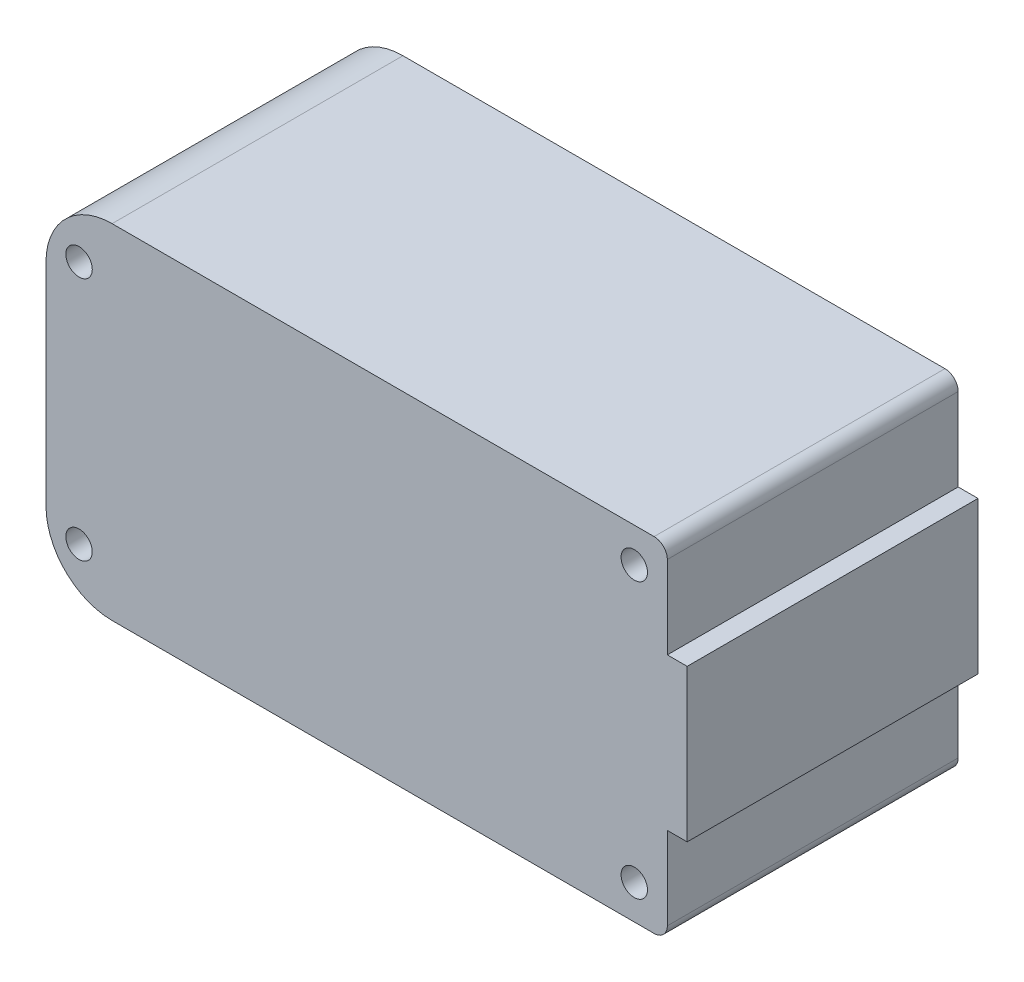
ISO-10303-21;
HEADER;
FILE_DESCRIPTION(('STEP AP214'),'2;1');
FILE_NAME('part.step','',(''),(''),'','','');
FILE_SCHEMA(('AUTOMOTIVE_DESIGN { 1 0 10303 214 1 1 1 1 }'));
ENDSEC;
DATA;
#1=APPLICATION_CONTEXT('core data for automotive mechanical design processes');
#2=APPLICATION_PROTOCOL_DEFINITION('international standard','automotive_design',2000,#1);
#3=PRODUCT_CONTEXT('',#1,'mechanical');
#4=PRODUCT('Part','Part','',(#3));
#5=PRODUCT_RELATED_PRODUCT_CATEGORY('part','',(#4));
#6=PRODUCT_DEFINITION_FORMATION('','',#4);
#7=PRODUCT_DEFINITION_CONTEXT('part definition',#1,'design');
#8=PRODUCT_DEFINITION('design','',#6,#7);
#9=PRODUCT_DEFINITION_SHAPE('','',#8);
#10=(LENGTH_UNIT() NAMED_UNIT(*) SI_UNIT(.MILLI.,.METRE.));
#11=(NAMED_UNIT(*) PLANE_ANGLE_UNIT() SI_UNIT($,.RADIAN.));
#12=(NAMED_UNIT(*) SI_UNIT($,.STERADIAN.) SOLID_ANGLE_UNIT());
#13=UNCERTAINTY_MEASURE_WITH_UNIT(LENGTH_MEASURE(1.E-05),#10,'distance_accuracy_value','');
#14=(GEOMETRIC_REPRESENTATION_CONTEXT(3) GLOBAL_UNCERTAINTY_ASSIGNED_CONTEXT((#13)) GLOBAL_UNIT_ASSIGNED_CONTEXT((#10,
#11,#12)) REPRESENTATION_CONTEXT('',''));
#15=CARTESIAN_POINT('',(0.,0.,0.));
#16=DIRECTION('',(0.,0.,1.));
#17=DIRECTION('',(1.,0.,0.));
#18=AXIS2_PLACEMENT_3D('',#15,#16,#17);
#19=CARTESIAN_POINT('',(0.,0.,11.));
#20=DIRECTION('',(0.,0.,1.));
#21=DIRECTION('',(1.,0.,0.));
#22=AXIS2_PLACEMENT_3D('',#19,#20,#21);
#23=PLANE('',#22);
#24=CARTESIAN_POINT('',(33.,-10.4,11.));
#25=DIRECTION('',(0.,0.,1.));
#26=DIRECTION('',(-1.,0.,0.));
#27=AXIS2_PLACEMENT_3D('',#24,#25,#26);
#28=CIRCLE('',#27,0.999999999999998);
#29=CARTESIAN_POINT('',(32.,-10.4,11.));
#30=VERTEX_POINT('',#29);
#31=EDGE_CURVE('E264',#30,#30,#28,.T.);
#32=ORIENTED_EDGE('',*,*,#31,.F.);
#33=EDGE_LOOP('',(#32));
#34=FACE_BOUND('',#33,.T.);
#35=CARTESIAN_POINT('',(-9.,9.25,11.));
#36=DIRECTION('',(0.,0.,1.));
#37=DIRECTION('',(1.,0.,0.));
#38=AXIS2_PLACEMENT_3D('',#35,#36,#37);
#39=CIRCLE('',#38,1.);
#40=CARTESIAN_POINT('',(-7.99999999999999,9.25,11.));
#41=VERTEX_POINT('',#40);
#42=EDGE_CURVE('E163',#41,#41,#39,.T.);
#43=ORIENTED_EDGE('',*,*,#42,.F.);
#44=EDGE_LOOP('',(#43));
#45=FACE_BOUND('',#44,.T.);
#46=DIRECTION('',(0.,1.,0.));
#47=VECTOR('',#46,1.);
#48=CARTESIAN_POINT('',(35.5,5.75,11.));
#49=LINE('',#48,#47);
#50=CARTESIAN_POINT('',(35.5,5.75,11.));
#51=VERTEX_POINT('',#50);
#52=CARTESIAN_POINT('',(35.5,12.,11.));
#53=VERTEX_POINT('',#52);
#54=EDGE_CURVE('E154',#51,#53,#49,.T.);
#55=ORIENTED_EDGE('',*,*,#54,.T.);
#56=CARTESIAN_POINT('',(34.5,12.,11.));
#57=DIRECTION('',(0.,0.,1.));
#58=DIRECTION('',(1.,0.,0.));
#59=AXIS2_PLACEMENT_3D('',#56,#57,#58);
#60=CIRCLE('',#59,1.);
#61=CARTESIAN_POINT('',(34.5,13.,11.));
#62=VERTEX_POINT('',#61);
#63=EDGE_CURVE('E213',#53,#62,#60,.T.);
#64=ORIENTED_EDGE('',*,*,#63,.T.);
#65=DIRECTION('',(-1.,0.,0.));
#66=VECTOR('',#65,1.);
#67=CARTESIAN_POINT('',(35.5,13.,11.));
#68=LINE('',#67,#66);
#69=CARTESIAN_POINT('',(-6.5,13.,11.));
#70=VERTEX_POINT('',#69);
#71=EDGE_CURVE('E156',#62,#70,#68,.T.);
#72=ORIENTED_EDGE('',*,*,#71,.T.);
#73=CARTESIAN_POINT('',(-6.5,7.99999999999999,11.));
#74=DIRECTION('',(0.,0.,1.));
#75=DIRECTION('',(1.,0.,0.));
#76=AXIS2_PLACEMENT_3D('',#73,#74,#75);
#77=CIRCLE('',#76,5.);
#78=CARTESIAN_POINT('',(-11.5,7.99999999999999,11.));
#79=VERTEX_POINT('',#78);
#80=EDGE_CURVE('E198',#70,#79,#77,.T.);
#81=ORIENTED_EDGE('',*,*,#80,.T.);
#82=DIRECTION('',(0.,-1.,0.));
#83=VECTOR('',#82,1.);
#84=CARTESIAN_POINT('',(-11.5,-13.,11.));
#85=LINE('',#84,#83);
#86=CARTESIAN_POINT('',(-11.5,-8.00000000000001,11.));
#87=VERTEX_POINT('',#86);
#88=EDGE_CURVE('E177',#79,#87,#85,.T.);
#89=ORIENTED_EDGE('',*,*,#88,.T.);
#90=CARTESIAN_POINT('',(-6.5,-8.,11.));
#91=DIRECTION('',(0.,0.,1.));
#92=DIRECTION('',(1.,0.,0.));
#93=AXIS2_PLACEMENT_3D('',#90,#91,#92);
#94=CIRCLE('',#93,5.);
#95=CARTESIAN_POINT('',(-6.5,-13.,11.));
#96=VERTEX_POINT('',#95);
#97=EDGE_CURVE('E196',#87,#96,#94,.T.);
#98=ORIENTED_EDGE('',*,*,#97,.T.);
#99=DIRECTION('',(1.,0.,0.));
#100=VECTOR('',#99,1.);
#101=CARTESIAN_POINT('',(35.5,-13.,11.));
#102=LINE('',#101,#100);
#103=CARTESIAN_POINT('',(34.5,-13.,11.));
#104=VERTEX_POINT('',#103);
#105=EDGE_CURVE('E132',#96,#104,#102,.T.);
#106=ORIENTED_EDGE('',*,*,#105,.T.);
#107=CARTESIAN_POINT('',(34.5,-12.,11.));
#108=DIRECTION('',(0.,0.,1.));
#109=DIRECTION('',(1.,0.,0.));
#110=AXIS2_PLACEMENT_3D('',#107,#108,#109);
#111=CIRCLE('',#110,1.);
#112=CARTESIAN_POINT('',(35.5,-12.,11.));
#113=VERTEX_POINT('',#112);
#114=EDGE_CURVE('E51',#104,#113,#111,.T.);
#115=ORIENTED_EDGE('',*,*,#114,.T.);
#116=DIRECTION('',(0.,1.,0.));
#117=VECTOR('',#116,1.);
#118=CARTESIAN_POINT('',(35.5,-13.,11.));
#119=LINE('',#118,#117);
#120=CARTESIAN_POINT('',(35.5,-5.75,11.));
#121=VERTEX_POINT('',#120);
#122=EDGE_CURVE('E122',#113,#121,#119,.T.);
#123=ORIENTED_EDGE('',*,*,#122,.T.);
#124=DIRECTION('',(1.,0.,0.));
#125=VECTOR('',#124,1.);
#126=CARTESIAN_POINT('',(35.5,-5.75,11.));
#127=LINE('',#126,#125);
#128=CARTESIAN_POINT('',(37.,-5.75,11.));
#129=VERTEX_POINT('',#128);
#130=EDGE_CURVE('E127',#121,#129,#127,.T.);
#131=ORIENTED_EDGE('',*,*,#130,.T.);
#132=DIRECTION('',(0.,1.,0.));
#133=VECTOR('',#132,1.);
#134=CARTESIAN_POINT('',(37.,5.75,11.));
#135=LINE('',#134,#133);
#136=CARTESIAN_POINT('',(37.,5.75,11.));
#137=VERTEX_POINT('',#136);
#138=EDGE_CURVE('E147',#129,#137,#135,.T.);
#139=ORIENTED_EDGE('',*,*,#138,.T.);
#140=DIRECTION('',(-1.,0.,0.));
#141=VECTOR('',#140,1.);
#142=CARTESIAN_POINT('',(35.5,5.75,11.));
#143=LINE('',#142,#141);
#144=EDGE_CURVE('E149',#137,#51,#143,.T.);
#145=ORIENTED_EDGE('',*,*,#144,.T.);
#146=EDGE_LOOP('',(#55,#64,#72,#81,#89,#98,#106,#115,#123,#131,#139,#145));
#147=FACE_BOUND('',#146,.T.);
#148=CARTESIAN_POINT('',(33.,10.4,11.));
#149=DIRECTION('',(0.,0.,1.));
#150=DIRECTION('',(1.,0.,0.));
#151=AXIS2_PLACEMENT_3D('',#148,#149,#150);
#152=CIRCLE('',#151,0.999999999999998);
#153=CARTESIAN_POINT('',(34.,10.4,11.));
#154=VERTEX_POINT('',#153);
#155=EDGE_CURVE('E258',#154,#154,#152,.T.);
#156=ORIENTED_EDGE('',*,*,#155,.F.);
#157=EDGE_LOOP('',(#156));
#158=FACE_BOUND('',#157,.T.);
#159=CARTESIAN_POINT('',(-9.,-9.25,11.));
#160=DIRECTION('',(0.,0.,1.));
#161=DIRECTION('',(-1.,0.,0.));
#162=AXIS2_PLACEMENT_3D('',#159,#160,#161);
#163=CIRCLE('',#162,1.);
#164=CARTESIAN_POINT('',(-10.,-9.25,11.));
#165=VERTEX_POINT('',#164);
#166=EDGE_CURVE('E270',#165,#165,#163,.T.);
#167=ORIENTED_EDGE('',*,*,#166,.F.);
#168=EDGE_LOOP('',(#167));
#169=FACE_BOUND('',#168,.T.);
#170=ADVANCED_FACE('F36',(#34,#45,#147,#158,#169),#23,.T.);
#171=CARTESIAN_POINT('',(0.,0.,-11.));
#172=DIRECTION('',(0.,0.,1.));
#173=DIRECTION('',(1.,0.,0.));
#174=AXIS2_PLACEMENT_3D('',#171,#172,#173);
#175=PLANE('',#174);
#176=CARTESIAN_POINT('',(33.,-10.4,-11.));
#177=DIRECTION('',(0.,0.,1.));
#178=DIRECTION('',(-1.,0.,0.));
#179=AXIS2_PLACEMENT_3D('',#176,#177,#178);
#180=CIRCLE('',#179,0.999999999999998);
#181=CARTESIAN_POINT('',(32.,-10.4,-11.));
#182=VERTEX_POINT('',#181);
#183=EDGE_CURVE('E267',#182,#182,#180,.T.);
#184=ORIENTED_EDGE('',*,*,#183,.T.);
#185=EDGE_LOOP('',(#184));
#186=FACE_BOUND('',#185,.T.);
#187=CARTESIAN_POINT('',(-9.,9.25,-11.));
#188=DIRECTION('',(0.,0.,1.));
#189=DIRECTION('',(1.,0.,0.));
#190=AXIS2_PLACEMENT_3D('',#187,#188,#189);
#191=CIRCLE('',#190,1.);
#192=CARTESIAN_POINT('',(-7.99999999999999,9.25,-11.));
#193=VERTEX_POINT('',#192);
#194=EDGE_CURVE('E255',#193,#193,#191,.T.);
#195=ORIENTED_EDGE('',*,*,#194,.T.);
#196=EDGE_LOOP('',(#195));
#197=FACE_BOUND('',#196,.T.);
#198=DIRECTION('',(-1.,0.,0.));
#199=VECTOR('',#198,1.);
#200=CARTESIAN_POINT('',(35.5,13.,-11.));
#201=LINE('',#200,#199);
#202=CARTESIAN_POINT('',(34.5,13.,-11.));
#203=VERTEX_POINT('',#202);
#204=CARTESIAN_POINT('',(-6.5,13.,-11.));
#205=VERTEX_POINT('',#204);
#206=EDGE_CURVE('E175',#203,#205,#201,.T.);
#207=ORIENTED_EDGE('',*,*,#206,.F.);
#208=CARTESIAN_POINT('',(34.5,12.,-11.));
#209=DIRECTION('',(0.,0.,1.));
#210=DIRECTION('',(1.,0.,0.));
#211=AXIS2_PLACEMENT_3D('',#208,#209,#210);
#212=CIRCLE('',#211,1.);
#213=CARTESIAN_POINT('',(35.5,12.,-11.));
#214=VERTEX_POINT('',#213);
#215=EDGE_CURVE('E208',#203,#214,#212,.F.);
#216=ORIENTED_EDGE('',*,*,#215,.T.);
#217=DIRECTION('',(0.,1.,0.));
#218=VECTOR('',#217,1.);
#219=CARTESIAN_POINT('',(35.5,5.75,-11.));
#220=LINE('',#219,#218);
#221=CARTESIAN_POINT('',(35.5,5.75,-11.));
#222=VERTEX_POINT('',#221);
#223=EDGE_CURVE('E172',#222,#214,#220,.T.);
#224=ORIENTED_EDGE('',*,*,#223,.F.);
#225=DIRECTION('',(-1.,0.,0.));
#226=VECTOR('',#225,1.);
#227=CARTESIAN_POINT('',(35.5,5.75,-11.));
#228=LINE('',#227,#226);
#229=CARTESIAN_POINT('',(37.,5.75,-11.));
#230=VERTEX_POINT('',#229);
#231=EDGE_CURVE('E170',#230,#222,#228,.T.);
#232=ORIENTED_EDGE('',*,*,#231,.F.);
#233=DIRECTION('',(0.,1.,0.));
#234=VECTOR('',#233,1.);
#235=CARTESIAN_POINT('',(37.,5.75,-11.));
#236=LINE('',#235,#234);
#237=CARTESIAN_POINT('',(37.,-5.75,-11.));
#238=VERTEX_POINT('',#237);
#239=EDGE_CURVE('E168',#238,#230,#236,.T.);
#240=ORIENTED_EDGE('',*,*,#239,.F.);
#241=DIRECTION('',(1.,0.,0.));
#242=VECTOR('',#241,1.);
#243=CARTESIAN_POINT('',(35.5,-5.75,-11.));
#244=LINE('',#243,#242);
#245=CARTESIAN_POINT('',(35.5,-5.75,-11.));
#246=VERTEX_POINT('',#245);
#247=EDGE_CURVE('E166',#246,#238,#244,.T.);
#248=ORIENTED_EDGE('',*,*,#247,.F.);
#249=DIRECTION('',(0.,1.,0.));
#250=VECTOR('',#249,1.);
#251=CARTESIAN_POINT('',(35.5,-13.,-11.));
#252=LINE('',#251,#250);
#253=CARTESIAN_POINT('',(35.5,-12.,-11.));
#254=VERTEX_POINT('',#253);
#255=EDGE_CURVE('E138',#254,#246,#252,.T.);
#256=ORIENTED_EDGE('',*,*,#255,.F.);
#257=CARTESIAN_POINT('',(34.5,-12.,-11.));
#258=DIRECTION('',(0.,0.,1.));
#259=DIRECTION('',(1.,0.,0.));
#260=AXIS2_PLACEMENT_3D('',#257,#258,#259);
#261=CIRCLE('',#260,1.);
#262=CARTESIAN_POINT('',(34.5,-13.,-11.));
#263=VERTEX_POINT('',#262);
#264=EDGE_CURVE('E206',#254,#263,#261,.F.);
#265=ORIENTED_EDGE('',*,*,#264,.T.);
#266=DIRECTION('',(1.,0.,0.));
#267=VECTOR('',#266,1.);
#268=CARTESIAN_POINT('',(35.5,-13.,-11.));
#269=LINE('',#268,#267);
#270=CARTESIAN_POINT('',(-6.5,-13.,-11.));
#271=VERTEX_POINT('',#270);
#272=EDGE_CURVE('E162',#271,#263,#269,.T.);
#273=ORIENTED_EDGE('',*,*,#272,.F.);
#274=CARTESIAN_POINT('',(-6.5,-8.,-11.));
#275=DIRECTION('',(0.,0.,1.));
#276=DIRECTION('',(1.,0.,0.));
#277=AXIS2_PLACEMENT_3D('',#274,#275,#276);
#278=CIRCLE('',#277,5.);
#279=CARTESIAN_POINT('',(-11.5,-8.00000000000001,-11.));
#280=VERTEX_POINT('',#279);
#281=EDGE_CURVE('E188',#271,#280,#278,.F.);
#282=ORIENTED_EDGE('',*,*,#281,.T.);
#283=DIRECTION('',(0.,-1.,0.));
#284=VECTOR('',#283,1.);
#285=CARTESIAN_POINT('',(-11.5,-13.,-11.));
#286=LINE('',#285,#284);
#287=CARTESIAN_POINT('',(-11.5,7.99999999999999,-11.));
#288=VERTEX_POINT('',#287);
#289=EDGE_CURVE('E159',#288,#280,#286,.T.);
#290=ORIENTED_EDGE('',*,*,#289,.F.);
#291=CARTESIAN_POINT('',(-6.5,7.99999999999999,-11.));
#292=DIRECTION('',(0.,0.,1.));
#293=DIRECTION('',(1.,0.,0.));
#294=AXIS2_PLACEMENT_3D('',#291,#292,#293);
#295=CIRCLE('',#294,5.);
#296=EDGE_CURVE('E190',#288,#205,#295,.F.);
#297=ORIENTED_EDGE('',*,*,#296,.T.);
#298=EDGE_LOOP('',(#207,#216,#224,#232,#240,#248,#256,#265,#273,#282,#290,#297));
#299=FACE_BOUND('',#298,.T.);
#300=CARTESIAN_POINT('',(33.,10.4,-11.));
#301=DIRECTION('',(0.,0.,1.));
#302=DIRECTION('',(1.,0.,0.));
#303=AXIS2_PLACEMENT_3D('',#300,#301,#302);
#304=CIRCLE('',#303,0.999999999999998);
#305=CARTESIAN_POINT('',(34.,10.4,-11.));
#306=VERTEX_POINT('',#305);
#307=EDGE_CURVE('E261',#306,#306,#304,.T.);
#308=ORIENTED_EDGE('',*,*,#307,.T.);
#309=EDGE_LOOP('',(#308));
#310=FACE_BOUND('',#309,.T.);
#311=CARTESIAN_POINT('',(-9.,-9.25,-11.));
#312=DIRECTION('',(0.,0.,1.));
#313=DIRECTION('',(-1.,0.,0.));
#314=AXIS2_PLACEMENT_3D('',#311,#312,#313);
#315=CIRCLE('',#314,1.);
#316=CARTESIAN_POINT('',(-10.,-9.25,-11.));
#317=VERTEX_POINT('',#316);
#318=EDGE_CURVE('E273',#317,#317,#315,.T.);
#319=ORIENTED_EDGE('',*,*,#318,.T.);
#320=EDGE_LOOP('',(#319));
#321=FACE_BOUND('',#320,.T.);
#322=ADVANCED_FACE('F217',(#186,#197,#299,#310,#321),#175,.F.);
#323=CARTESIAN_POINT('',(-11.5,-13.,11.));
#324=DIRECTION('',(1.,0.,0.));
#325=DIRECTION('',(0.,1.,0.));
#326=AXIS2_PLACEMENT_3D('',#323,#324,#325);
#327=PLANE('',#326);
#328=ORIENTED_EDGE('',*,*,#88,.F.);
#329=DIRECTION('',(0.,0.,-1.));
#330=VECTOR('',#329,1.);
#331=CARTESIAN_POINT('',(-11.5,7.99999999999999,11.));
#332=LINE('',#331,#330);
#333=EDGE_CURVE('E185',#79,#288,#332,.T.);
#334=ORIENTED_EDGE('',*,*,#333,.T.);
#335=ORIENTED_EDGE('',*,*,#289,.T.);
#336=DIRECTION('',(0.,0.,-1.));
#337=VECTOR('',#336,1.);
#338=CARTESIAN_POINT('',(-11.5,-8.,11.));
#339=LINE('',#338,#337);
#340=EDGE_CURVE('E141',#280,#87,#339,.F.);
#341=ORIENTED_EDGE('',*,*,#340,.T.);
#342=EDGE_LOOP('',(#328,#334,#335,#341));
#343=FACE_BOUND('',#342,.T.);
#344=ADVANCED_FACE('F250',(#343),#327,.F.);
#345=CARTESIAN_POINT('',(35.5,-13.,11.));
#346=DIRECTION('',(0.,1.,0.));
#347=DIRECTION('',(-1.,0.,0.));
#348=AXIS2_PLACEMENT_3D('',#345,#346,#347);
#349=PLANE('',#348);
#350=ORIENTED_EDGE('',*,*,#272,.T.);
#351=DIRECTION('',(0.,0.,-1.));
#352=VECTOR('',#351,1.);
#353=CARTESIAN_POINT('',(34.5,-13.,11.));
#354=LINE('',#353,#352);
#355=EDGE_CURVE('E11',#263,#104,#354,.F.);
#356=ORIENTED_EDGE('',*,*,#355,.T.);
#357=ORIENTED_EDGE('',*,*,#105,.F.);
#358=DIRECTION('',(0.,0.,-1.));
#359=VECTOR('',#358,1.);
#360=CARTESIAN_POINT('',(-6.5,-13.,11.));
#361=LINE('',#360,#359);
#362=EDGE_CURVE('E200',#96,#271,#361,.T.);
#363=ORIENTED_EDGE('',*,*,#362,.T.);
#364=EDGE_LOOP('',(#350,#356,#357,#363));
#365=FACE_BOUND('',#364,.T.);
#366=ADVANCED_FACE('F308',(#365),#349,.F.);
#367=CARTESIAN_POINT('',(35.5,-13.,11.));
#368=DIRECTION('',(-1.,0.,0.));
#369=DIRECTION('',(0.,0.,1.));
#370=AXIS2_PLACEMENT_3D('',#367,#368,#369);
#371=PLANE('',#370);
#372=ORIENTED_EDGE('',*,*,#122,.F.);
#373=DIRECTION('',(0.,0.,-1.));
#374=VECTOR('',#373,1.);
#375=CARTESIAN_POINT('',(35.5,-12.,11.));
#376=LINE('',#375,#374);
#377=EDGE_CURVE('E44',#113,#254,#376,.T.);
#378=ORIENTED_EDGE('',*,*,#377,.T.);
#379=ORIENTED_EDGE('',*,*,#255,.T.);
#380=DIRECTION('',(0.,0.,-1.));
#381=VECTOR('',#380,1.);
#382=CARTESIAN_POINT('',(35.5,-5.75,11.));
#383=LINE('',#382,#381);
#384=EDGE_CURVE('E135',#121,#246,#383,.T.);
#385=ORIENTED_EDGE('',*,*,#384,.F.);
#386=EDGE_LOOP('',(#372,#378,#379,#385));
#387=FACE_BOUND('',#386,.T.);
#388=ADVANCED_FACE('F136',(#387),#371,.F.);
#389=CARTESIAN_POINT('',(35.5,-5.75,11.));
#390=DIRECTION('',(0.,1.,0.));
#391=DIRECTION('',(0.,0.,1.));
#392=AXIS2_PLACEMENT_3D('',#389,#390,#391);
#393=PLANE('',#392);
#394=ORIENTED_EDGE('',*,*,#247,.T.);
#395=DIRECTION('',(0.,0.,-1.));
#396=VECTOR('',#395,1.);
#397=CARTESIAN_POINT('',(37.,-5.75,11.));
#398=LINE('',#397,#396);
#399=EDGE_CURVE('E142',#129,#238,#398,.T.);
#400=ORIENTED_EDGE('',*,*,#399,.F.);
#401=ORIENTED_EDGE('',*,*,#130,.F.);
#402=ORIENTED_EDGE('',*,*,#384,.T.);
#403=EDGE_LOOP('',(#394,#400,#401,#402));
#404=FACE_BOUND('',#403,.T.);
#405=ADVANCED_FACE('F144',(#404),#393,.F.);
#406=CARTESIAN_POINT('',(37.,5.75,11.));
#407=DIRECTION('',(-1.,0.,0.));
#408=DIRECTION('',(0.,0.,1.));
#409=AXIS2_PLACEMENT_3D('',#406,#407,#408);
#410=PLANE('',#409);
#411=ORIENTED_EDGE('',*,*,#239,.T.);
#412=DIRECTION('',(0.,0.,-1.));
#413=VECTOR('',#412,1.);
#414=CARTESIAN_POINT('',(37.,5.75,11.));
#415=LINE('',#414,#413);
#416=EDGE_CURVE('E180',#137,#230,#415,.T.);
#417=ORIENTED_EDGE('',*,*,#416,.F.);
#418=ORIENTED_EDGE('',*,*,#138,.F.);
#419=ORIENTED_EDGE('',*,*,#399,.T.);
#420=EDGE_LOOP('',(#411,#417,#418,#419));
#421=FACE_BOUND('',#420,.T.);
#422=ADVANCED_FACE('F223',(#421),#410,.F.);
#423=CARTESIAN_POINT('',(35.5,5.75,11.));
#424=DIRECTION('',(0.,-1.,0.));
#425=DIRECTION('',(0.,0.,-1.));
#426=AXIS2_PLACEMENT_3D('',#423,#424,#425);
#427=PLANE('',#426);
#428=ORIENTED_EDGE('',*,*,#231,.T.);
#429=DIRECTION('',(0.,0.,-1.));
#430=VECTOR('',#429,1.);
#431=CARTESIAN_POINT('',(35.5,5.75,11.));
#432=LINE('',#431,#430);
#433=EDGE_CURVE('E158',#51,#222,#432,.T.);
#434=ORIENTED_EDGE('',*,*,#433,.F.);
#435=ORIENTED_EDGE('',*,*,#144,.F.);
#436=ORIENTED_EDGE('',*,*,#416,.T.);
#437=EDGE_LOOP('',(#428,#434,#435,#436));
#438=FACE_BOUND('',#437,.T.);
#439=ADVANCED_FACE('F230',(#438),#427,.F.);
#440=CARTESIAN_POINT('',(35.5,5.75,11.));
#441=DIRECTION('',(-1.,0.,0.));
#442=DIRECTION('',(0.,0.,1.));
#443=AXIS2_PLACEMENT_3D('',#440,#441,#442);
#444=PLANE('',#443);
#445=ORIENTED_EDGE('',*,*,#223,.T.);
#446=DIRECTION('',(0.,0.,-1.));
#447=VECTOR('',#446,1.);
#448=CARTESIAN_POINT('',(35.5,12.,11.));
#449=LINE('',#448,#447);
#450=EDGE_CURVE('E210',#214,#53,#449,.F.);
#451=ORIENTED_EDGE('',*,*,#450,.T.);
#452=ORIENTED_EDGE('',*,*,#54,.F.);
#453=ORIENTED_EDGE('',*,*,#433,.T.);
#454=EDGE_LOOP('',(#445,#451,#452,#453));
#455=FACE_BOUND('',#454,.T.);
#456=ADVANCED_FACE('F233',(#455),#444,.F.);
#457=CARTESIAN_POINT('',(35.5,13.,11.));
#458=DIRECTION('',(0.,-1.,0.));
#459=DIRECTION('',(1.,0.,0.));
#460=AXIS2_PLACEMENT_3D('',#457,#458,#459);
#461=PLANE('',#460);
#462=ORIENTED_EDGE('',*,*,#71,.F.);
#463=DIRECTION('',(0.,0.,-1.));
#464=VECTOR('',#463,1.);
#465=CARTESIAN_POINT('',(34.5,13.,11.));
#466=LINE('',#465,#464);
#467=EDGE_CURVE('E203',#62,#203,#466,.T.);
#468=ORIENTED_EDGE('',*,*,#467,.T.);
#469=ORIENTED_EDGE('',*,*,#206,.T.);
#470=DIRECTION('',(0.,0.,-1.));
#471=VECTOR('',#470,1.);
#472=CARTESIAN_POINT('',(-6.5,13.,11.));
#473=LINE('',#472,#471);
#474=EDGE_CURVE('E193',#205,#70,#473,.F.);
#475=ORIENTED_EDGE('',*,*,#474,.T.);
#476=EDGE_LOOP('',(#462,#468,#469,#475));
#477=FACE_BOUND('',#476,.T.);
#478=ADVANCED_FACE('F240',(#477),#461,.F.);
#479=CARTESIAN_POINT('',(-9.,9.25,11.));
#480=DIRECTION('',(0.,0.,-1.));
#481=DIRECTION('',(-1.,0.,0.));
#482=AXIS2_PLACEMENT_3D('',#479,#480,#481);
#483=CYLINDRICAL_SURFACE('',#482,1.);
#484=ORIENTED_EDGE('',*,*,#42,.T.);
#485=EDGE_LOOP('',(#484));
#486=FACE_BOUND('',#485,.T.);
#487=ORIENTED_EDGE('',*,*,#194,.F.);
#488=EDGE_LOOP('',(#487));
#489=FACE_BOUND('',#488,.T.);
#490=ADVANCED_FACE('F293',(#486,#489),#483,.F.);
#491=CARTESIAN_POINT('',(33.,10.4,11.));
#492=DIRECTION('',(0.,0.,-1.));
#493=DIRECTION('',(-1.,0.,0.));
#494=AXIS2_PLACEMENT_3D('',#491,#492,#493);
#495=CYLINDRICAL_SURFACE('',#494,0.999999999999998);
#496=ORIENTED_EDGE('',*,*,#155,.T.);
#497=EDGE_LOOP('',(#496));
#498=FACE_BOUND('',#497,.T.);
#499=ORIENTED_EDGE('',*,*,#307,.F.);
#500=EDGE_LOOP('',(#499));
#501=FACE_BOUND('',#500,.T.);
#502=ADVANCED_FACE('F402',(#498,#501),#495,.F.);
#503=CARTESIAN_POINT('',(33.,-10.4,11.));
#504=DIRECTION('',(0.,0.,-1.));
#505=DIRECTION('',(-1.,0.,0.));
#506=AXIS2_PLACEMENT_3D('',#503,#504,#505);
#507=CYLINDRICAL_SURFACE('',#506,0.999999999999998);
#508=ORIENTED_EDGE('',*,*,#31,.T.);
#509=EDGE_LOOP('',(#508));
#510=FACE_BOUND('',#509,.T.);
#511=ORIENTED_EDGE('',*,*,#183,.F.);
#512=EDGE_LOOP('',(#511));
#513=FACE_BOUND('',#512,.T.);
#514=ADVANCED_FACE('F393',(#510,#513),#507,.F.);
#515=CARTESIAN_POINT('',(-9.,-9.25,11.));
#516=DIRECTION('',(0.,0.,-1.));
#517=DIRECTION('',(-1.,0.,0.));
#518=AXIS2_PLACEMENT_3D('',#515,#516,#517);
#519=CYLINDRICAL_SURFACE('',#518,1.);
#520=ORIENTED_EDGE('',*,*,#166,.T.);
#521=EDGE_LOOP('',(#520));
#522=FACE_BOUND('',#521,.T.);
#523=ORIENTED_EDGE('',*,*,#318,.F.);
#524=EDGE_LOOP('',(#523));
#525=FACE_BOUND('',#524,.T.);
#526=ADVANCED_FACE('F279',(#522,#525),#519,.F.);
#527=CARTESIAN_POINT('',(-6.5,7.99999999999999,11.));
#528=DIRECTION('',(0.,0.,-1.));
#529=DIRECTION('',(-1.,0.,0.));
#530=AXIS2_PLACEMENT_3D('',#527,#528,#529);
#531=CYLINDRICAL_SURFACE('',#530,5.);
#532=ORIENTED_EDGE('',*,*,#80,.F.);
#533=ORIENTED_EDGE('',*,*,#474,.F.);
#534=ORIENTED_EDGE('',*,*,#296,.F.);
#535=ORIENTED_EDGE('',*,*,#333,.F.);
#536=EDGE_LOOP('',(#532,#533,#534,#535));
#537=FACE_BOUND('',#536,.T.);
#538=ADVANCED_FACE('F245',(#537),#531,.T.);
#539=CARTESIAN_POINT('',(-6.5,-8.,11.));
#540=DIRECTION('',(0.,0.,-1.));
#541=DIRECTION('',(-1.,0.,0.));
#542=AXIS2_PLACEMENT_3D('',#539,#540,#541);
#543=CYLINDRICAL_SURFACE('',#542,5.);
#544=ORIENTED_EDGE('',*,*,#97,.F.);
#545=ORIENTED_EDGE('',*,*,#340,.F.);
#546=ORIENTED_EDGE('',*,*,#281,.F.);
#547=ORIENTED_EDGE('',*,*,#362,.F.);
#548=EDGE_LOOP('',(#544,#545,#546,#547));
#549=FACE_BOUND('',#548,.T.);
#550=ADVANCED_FACE('F315',(#549),#543,.T.);
#551=CARTESIAN_POINT('',(34.5,12.,11.));
#552=DIRECTION('',(0.,0.,-1.));
#553=DIRECTION('',(-1.,0.,0.));
#554=AXIS2_PLACEMENT_3D('',#551,#552,#553);
#555=CYLINDRICAL_SURFACE('',#554,1.);
#556=ORIENTED_EDGE('',*,*,#63,.F.);
#557=ORIENTED_EDGE('',*,*,#450,.F.);
#558=ORIENTED_EDGE('',*,*,#215,.F.);
#559=ORIENTED_EDGE('',*,*,#467,.F.);
#560=EDGE_LOOP('',(#556,#557,#558,#559));
#561=FACE_BOUND('',#560,.T.);
#562=ADVANCED_FACE('F236',(#561),#555,.T.);
#563=CARTESIAN_POINT('',(34.5,-12.,11.));
#564=DIRECTION('',(0.,0.,-1.));
#565=DIRECTION('',(-1.,0.,0.));
#566=AXIS2_PLACEMENT_3D('',#563,#564,#565);
#567=CYLINDRICAL_SURFACE('',#566,1.);
#568=ORIENTED_EDGE('',*,*,#114,.F.);
#569=ORIENTED_EDGE('',*,*,#355,.F.);
#570=ORIENTED_EDGE('',*,*,#264,.F.);
#571=ORIENTED_EDGE('',*,*,#377,.F.);
#572=EDGE_LOOP('',(#568,#569,#570,#571));
#573=FACE_BOUND('',#572,.T.);
#574=ADVANCED_FACE('F38',(#573),#567,.T.);
#575=CLOSED_SHELL('',(#170,#322,#344,#366,#388,#405,#422,#439,#456,#478,#490,#502,#514,#526,
#538,#550,#562,#574));
#576=MANIFOLD_SOLID_BREP('B2',#575);
#577=ADVANCED_BREP_SHAPE_REPRESENTATION('',(#18,#576),#14);
#578=SHAPE_DEFINITION_REPRESENTATION(#9,#577);
ENDSEC;
END-ISO-10303-21;
